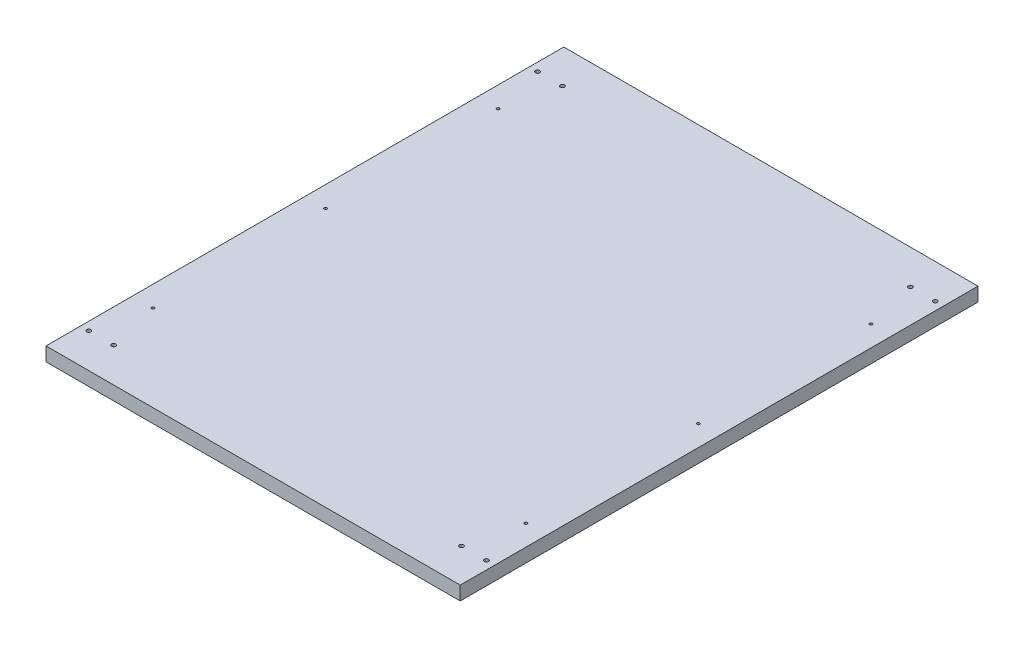
ISO-10303-21;
HEADER;
FILE_DESCRIPTION(('STEP AP214'),'2;1');
FILE_NAME('part.step','',(''),(''),'','','');
FILE_SCHEMA(('AUTOMOTIVE_DESIGN { 1 0 10303 214 1 1 1 1 }'));
ENDSEC;
DATA;
#1=APPLICATION_CONTEXT('core data for automotive mechanical design processes');
#2=APPLICATION_PROTOCOL_DEFINITION('international standard','automotive_design',2000,#1);
#3=PRODUCT_CONTEXT('',#1,'mechanical');
#4=PRODUCT('Part','Part','',(#3));
#5=PRODUCT_RELATED_PRODUCT_CATEGORY('part','',(#4));
#6=PRODUCT_DEFINITION_FORMATION('','',#4);
#7=PRODUCT_DEFINITION_CONTEXT('part definition',#1,'design');
#8=PRODUCT_DEFINITION('design','',#6,#7);
#9=PRODUCT_DEFINITION_SHAPE('','',#8);
#10=(LENGTH_UNIT() NAMED_UNIT(*) SI_UNIT(.MILLI.,.METRE.));
#11=(NAMED_UNIT(*) PLANE_ANGLE_UNIT() SI_UNIT($,.RADIAN.));
#12=(NAMED_UNIT(*) SI_UNIT($,.STERADIAN.) SOLID_ANGLE_UNIT());
#13=UNCERTAINTY_MEASURE_WITH_UNIT(LENGTH_MEASURE(1.E-05),#10,'distance_accuracy_value','');
#14=(GEOMETRIC_REPRESENTATION_CONTEXT(3) GLOBAL_UNCERTAINTY_ASSIGNED_CONTEXT((#13)) GLOBAL_UNIT_ASSIGNED_CONTEXT((#10,
#11,#12)) REPRESENTATION_CONTEXT('',''));
#15=CARTESIAN_POINT('',(0.,0.,0.));
#16=DIRECTION('',(0.,0.,1.));
#17=DIRECTION('',(1.,0.,0.));
#18=AXIS2_PLACEMENT_3D('',#15,#16,#17);
#19=CARTESIAN_POINT('',(0.,20.,-750.));
#20=DIRECTION('',(1.,0.,0.));
#21=DIRECTION('',(0.,0.,-1.));
#22=AXIS2_PLACEMENT_3D('',#19,#20,#21);
#23=PLANE('',#22);
#24=DIRECTION('',(0.,0.,1.));
#25=VECTOR('',#24,1.);
#26=CARTESIAN_POINT('',(0.,0.,-750.));
#27=LINE('',#26,#25);
#28=CARTESIAN_POINT('',(0.,0.,-750.));
#29=VERTEX_POINT('',#28);
#30=CARTESIAN_POINT('',(0.,0.,0.));
#31=VERTEX_POINT('',#30);
#32=EDGE_CURVE('E106',#29,#31,#27,.T.);
#33=ORIENTED_EDGE('',*,*,#32,.T.);
#34=DIRECTION('',(0.,-1.,0.));
#35=VECTOR('',#34,1.);
#36=CARTESIAN_POINT('',(0.,20.,0.));
#37=LINE('',#36,#35);
#38=CARTESIAN_POINT('',(0.,20.,0.));
#39=VERTEX_POINT('',#38);
#40=EDGE_CURVE('E11',#39,#31,#37,.T.);
#41=ORIENTED_EDGE('',*,*,#40,.F.);
#42=DIRECTION('',(0.,0.,1.));
#43=VECTOR('',#42,1.);
#44=CARTESIAN_POINT('',(0.,20.,-750.));
#45=LINE('',#44,#43);
#46=CARTESIAN_POINT('',(0.,20.,-750.));
#47=VERTEX_POINT('',#46);
#48=EDGE_CURVE('E90',#47,#39,#45,.T.);
#49=ORIENTED_EDGE('',*,*,#48,.F.);
#50=DIRECTION('',(0.,-1.,0.));
#51=VECTOR('',#50,1.);
#52=CARTESIAN_POINT('',(0.,20.,-750.));
#53=LINE('',#52,#51);
#54=EDGE_CURVE('E102',#47,#29,#53,.T.);
#55=ORIENTED_EDGE('',*,*,#54,.T.);
#56=EDGE_LOOP('',(#33,#41,#49,#55));
#57=FACE_BOUND('',#56,.T.);
#58=ADVANCED_FACE('F38',(#57),#23,.F.);
#59=CARTESIAN_POINT('',(0.,20.,0.));
#60=DIRECTION('',(0.,0.,-1.));
#61=DIRECTION('',(-1.,0.,0.));
#62=AXIS2_PLACEMENT_3D('',#59,#60,#61);
#63=PLANE('',#62);
#64=DIRECTION('',(1.,0.,0.));
#65=VECTOR('',#64,1.);
#66=CARTESIAN_POINT('',(0.,0.,0.));
#67=LINE('',#66,#65);
#68=CARTESIAN_POINT('',(600.,0.,0.));
#69=VERTEX_POINT('',#68);
#70=EDGE_CURVE('E95',#31,#69,#67,.T.);
#71=ORIENTED_EDGE('',*,*,#70,.T.);
#72=DIRECTION('',(0.,-1.,0.));
#73=VECTOR('',#72,1.);
#74=CARTESIAN_POINT('',(600.,20.,0.));
#75=LINE('',#74,#73);
#76=CARTESIAN_POINT('',(600.,20.,0.));
#77=VERTEX_POINT('',#76);
#78=EDGE_CURVE('E47',#77,#69,#75,.T.);
#79=ORIENTED_EDGE('',*,*,#78,.F.);
#80=DIRECTION('',(1.,0.,0.));
#81=VECTOR('',#80,1.);
#82=CARTESIAN_POINT('',(0.,20.,0.));
#83=LINE('',#82,#81);
#84=EDGE_CURVE('E85',#39,#77,#83,.T.);
#85=ORIENTED_EDGE('',*,*,#84,.F.);
#86=ORIENTED_EDGE('',*,*,#40,.T.);
#87=EDGE_LOOP('',(#71,#79,#85,#86));
#88=FACE_BOUND('',#87,.T.);
#89=ADVANCED_FACE('F94',(#88),#63,.F.);
#90=CARTESIAN_POINT('',(600.,20.,0.));
#91=DIRECTION('',(-1.,0.,0.));
#92=DIRECTION('',(0.,0.,1.));
#93=AXIS2_PLACEMENT_3D('',#90,#91,#92);
#94=PLANE('',#93);
#95=DIRECTION('',(0.,0.,-1.));
#96=VECTOR('',#95,1.);
#97=CARTESIAN_POINT('',(600.,0.,0.));
#98=LINE('',#97,#96);
#99=CARTESIAN_POINT('',(600.,0.,-750.));
#100=VERTEX_POINT('',#99);
#101=EDGE_CURVE('E72',#69,#100,#98,.T.);
#102=ORIENTED_EDGE('',*,*,#101,.T.);
#103=DIRECTION('',(0.,-1.,0.));
#104=VECTOR('',#103,1.);
#105=CARTESIAN_POINT('',(600.,20.,-750.));
#106=LINE('',#105,#104);
#107=CARTESIAN_POINT('',(600.,20.,-750.));
#108=VERTEX_POINT('',#107);
#109=EDGE_CURVE('E97',#108,#100,#106,.T.);
#110=ORIENTED_EDGE('',*,*,#109,.F.);
#111=DIRECTION('',(0.,0.,-1.));
#112=VECTOR('',#111,1.);
#113=CARTESIAN_POINT('',(600.,20.,0.));
#114=LINE('',#113,#112);
#115=EDGE_CURVE('E88',#77,#108,#114,.T.);
#116=ORIENTED_EDGE('',*,*,#115,.F.);
#117=ORIENTED_EDGE('',*,*,#78,.T.);
#118=EDGE_LOOP('',(#102,#110,#116,#117));
#119=FACE_BOUND('',#118,.T.);
#120=ADVANCED_FACE('F98',(#119),#94,.F.);
#121=CARTESIAN_POINT('',(600.,20.,-750.));
#122=DIRECTION('',(0.,0.,1.));
#123=DIRECTION('',(1.,0.,0.));
#124=AXIS2_PLACEMENT_3D('',#121,#122,#123);
#125=PLANE('',#124);
#126=DIRECTION('',(-1.,0.,0.));
#127=VECTOR('',#126,1.);
#128=CARTESIAN_POINT('',(600.,0.,-750.));
#129=LINE('',#128,#127);
#130=EDGE_CURVE('E78',#100,#29,#129,.T.);
#131=ORIENTED_EDGE('',*,*,#130,.T.);
#132=ORIENTED_EDGE('',*,*,#54,.F.);
#133=DIRECTION('',(-1.,0.,0.));
#134=VECTOR('',#133,1.);
#135=CARTESIAN_POINT('',(600.,20.,-750.));
#136=LINE('',#135,#134);
#137=EDGE_CURVE('E55',#108,#47,#136,.T.);
#138=ORIENTED_EDGE('',*,*,#137,.F.);
#139=ORIENTED_EDGE('',*,*,#109,.T.);
#140=EDGE_LOOP('',(#131,#132,#138,#139));
#141=FACE_BOUND('',#140,.T.);
#142=ADVANCED_FACE('F120',(#141),#125,.F.);
#143=CARTESIAN_POINT('',(0.,20.,0.));
#144=DIRECTION('',(0.,1.,0.));
#145=DIRECTION('',(0.,0.,1.));
#146=AXIS2_PLACEMENT_3D('',#143,#144,#145);
#147=PLANE('',#146);
#148=CARTESIAN_POINT('',(570.,20.,-625.));
#149=DIRECTION('',(0.,1.,0.));
#150=DIRECTION('',(0.,0.,1.));
#151=AXIS2_PLACEMENT_3D('',#148,#149,#150);
#152=CIRCLE('',#151,2.);
#153=CARTESIAN_POINT('',(570.,20.,-623.));
#154=VERTEX_POINT('',#153);
#155=EDGE_CURVE('E224',#154,#154,#152,.T.);
#156=ORIENTED_EDGE('',*,*,#155,.F.);
#157=EDGE_LOOP('',(#156));
#158=FACE_BOUND('',#157,.T.);
#159=CARTESIAN_POINT('',(570.,20.,-375.));
#160=DIRECTION('',(0.,1.,0.));
#161=DIRECTION('',(0.,0.,1.));
#162=AXIS2_PLACEMENT_3D('',#159,#160,#161);
#163=CIRCLE('',#162,2.);
#164=CARTESIAN_POINT('',(570.,20.,-373.));
#165=VERTEX_POINT('',#164);
#166=EDGE_CURVE('E216',#165,#165,#163,.T.);
#167=ORIENTED_EDGE('',*,*,#166,.F.);
#168=EDGE_LOOP('',(#167));
#169=FACE_BOUND('',#168,.T.);
#170=CARTESIAN_POINT('',(30.,20.,-375.));
#171=DIRECTION('',(0.,1.,0.));
#172=DIRECTION('',(0.,0.,1.));
#173=AXIS2_PLACEMENT_3D('',#170,#171,#172);
#174=CIRCLE('',#173,2.);
#175=CARTESIAN_POINT('',(30.,20.,-373.));
#176=VERTEX_POINT('',#175);
#177=EDGE_CURVE('E208',#176,#176,#174,.T.);
#178=ORIENTED_EDGE('',*,*,#177,.F.);
#179=EDGE_LOOP('',(#178));
#180=FACE_BOUND('',#179,.T.);
#181=CARTESIAN_POINT('',(30.,20.,-125.));
#182=DIRECTION('',(0.,1.,0.));
#183=DIRECTION('',(0.,0.,1.));
#184=AXIS2_PLACEMENT_3D('',#181,#182,#183);
#185=CIRCLE('',#184,2.);
#186=CARTESIAN_POINT('',(30.,20.,-123.));
#187=VERTEX_POINT('',#186);
#188=EDGE_CURVE('E199',#187,#187,#185,.T.);
#189=ORIENTED_EDGE('',*,*,#188,.F.);
#190=EDGE_LOOP('',(#189));
#191=FACE_BOUND('',#190,.T.);
#192=CARTESIAN_POINT('',(570.,20.,-125.));
#193=DIRECTION('',(0.,1.,0.));
#194=DIRECTION('',(0.,0.,1.));
#195=AXIS2_PLACEMENT_3D('',#192,#193,#194);
#196=CIRCLE('',#195,2.);
#197=CARTESIAN_POINT('',(570.,20.,-123.));
#198=VERTEX_POINT('',#197);
#199=EDGE_CURVE('E231',#198,#198,#196,.T.);
#200=ORIENTED_EDGE('',*,*,#199,.F.);
#201=EDGE_LOOP('',(#200));
#202=FACE_BOUND('',#201,.T.);
#203=CARTESIAN_POINT('',(30.,20.,-625.));
#204=DIRECTION('',(0.,1.,0.));
#205=DIRECTION('',(0.,0.,1.));
#206=AXIS2_PLACEMENT_3D('',#203,#204,#205);
#207=CIRCLE('',#206,2.);
#208=CARTESIAN_POINT('',(30.,20.,-623.));
#209=VERTEX_POINT('',#208);
#210=EDGE_CURVE('E191',#209,#209,#207,.T.);
#211=ORIENTED_EDGE('',*,*,#210,.F.);
#212=EDGE_LOOP('',(#211));
#213=FACE_BOUND('',#212,.T.);
#214=CARTESIAN_POINT('',(552.,20.,-700.));
#215=DIRECTION('',(0.,1.,0.));
#216=DIRECTION('',(0.,0.,1.));
#217=AXIS2_PLACEMENT_3D('',#214,#215,#216);
#218=CIRCLE('',#217,3.00000000000005);
#219=CARTESIAN_POINT('',(552.,20.,-697.));
#220=VERTEX_POINT('',#219);
#221=EDGE_CURVE('E151',#220,#220,#218,.T.);
#222=ORIENTED_EDGE('',*,*,#221,.F.);
#223=EDGE_LOOP('',(#222));
#224=FACE_BOUND('',#223,.T.);
#225=CARTESIAN_POINT('',(12.,20.,-50.));
#226=DIRECTION('',(0.,1.,0.));
#227=DIRECTION('',(0.,0.,1.));
#228=AXIS2_PLACEMENT_3D('',#225,#226,#227);
#229=CIRCLE('',#228,3.);
#230=CARTESIAN_POINT('',(12.,20.,-47.));
#231=VERTEX_POINT('',#230);
#232=EDGE_CURVE('E160',#231,#231,#229,.T.);
#233=ORIENTED_EDGE('',*,*,#232,.F.);
#234=EDGE_LOOP('',(#233));
#235=FACE_BOUND('',#234,.T.);
#236=CARTESIAN_POINT('',(588.,20.,-50.));
#237=DIRECTION('',(0.,1.,0.));
#238=DIRECTION('',(0.,0.,1.));
#239=AXIS2_PLACEMENT_3D('',#236,#237,#238);
#240=CIRCLE('',#239,3.00000000000005);
#241=CARTESIAN_POINT('',(588.,20.,-47.));
#242=VERTEX_POINT('',#241);
#243=EDGE_CURVE('E135',#242,#242,#240,.T.);
#244=ORIENTED_EDGE('',*,*,#243,.F.);
#245=EDGE_LOOP('',(#244));
#246=FACE_BOUND('',#245,.T.);
#247=CARTESIAN_POINT('',(48.,20.,-50.));
#248=DIRECTION('',(0.,1.,0.));
#249=DIRECTION('',(0.,0.,1.));
#250=AXIS2_PLACEMENT_3D('',#247,#248,#249);
#251=CIRCLE('',#250,3.);
#252=CARTESIAN_POINT('',(48.,20.,-47.));
#253=VERTEX_POINT('',#252);
#254=EDGE_CURVE('E144',#253,#253,#251,.T.);
#255=ORIENTED_EDGE('',*,*,#254,.F.);
#256=EDGE_LOOP('',(#255));
#257=FACE_BOUND('',#256,.T.);
#258=CARTESIAN_POINT('',(588.,20.,-700.));
#259=DIRECTION('',(0.,1.,0.));
#260=DIRECTION('',(0.,0.,1.));
#261=AXIS2_PLACEMENT_3D('',#258,#259,#260);
#262=CIRCLE('',#261,3.00000000000005);
#263=CARTESIAN_POINT('',(588.,20.,-697.));
#264=VERTEX_POINT('',#263);
#265=EDGE_CURVE('E184',#264,#264,#262,.T.);
#266=ORIENTED_EDGE('',*,*,#265,.F.);
#267=EDGE_LOOP('',(#266));
#268=FACE_BOUND('',#267,.T.);
#269=CARTESIAN_POINT('',(47.9999999999999,20.,-700.));
#270=DIRECTION('',(0.,1.,0.));
#271=DIRECTION('',(0.,0.,1.));
#272=AXIS2_PLACEMENT_3D('',#269,#270,#271);
#273=CIRCLE('',#272,3.);
#274=CARTESIAN_POINT('',(47.9999999999999,20.,-697.));
#275=VERTEX_POINT('',#274);
#276=EDGE_CURVE('E176',#275,#275,#273,.T.);
#277=ORIENTED_EDGE('',*,*,#276,.F.);
#278=EDGE_LOOP('',(#277));
#279=FACE_BOUND('',#278,.T.);
#280=CARTESIAN_POINT('',(12.,20.,-700.));
#281=DIRECTION('',(0.,1.,0.));
#282=DIRECTION('',(0.,0.,1.));
#283=AXIS2_PLACEMENT_3D('',#280,#281,#282);
#284=CIRCLE('',#283,3.);
#285=CARTESIAN_POINT('',(12.,20.,-697.));
#286=VERTEX_POINT('',#285);
#287=EDGE_CURVE('E167',#286,#286,#284,.T.);
#288=ORIENTED_EDGE('',*,*,#287,.F.);
#289=EDGE_LOOP('',(#288));
#290=FACE_BOUND('',#289,.T.);
#291=CARTESIAN_POINT('',(552.,20.,-50.));
#292=DIRECTION('',(0.,1.,0.));
#293=DIRECTION('',(0.,0.,1.));
#294=AXIS2_PLACEMENT_3D('',#291,#292,#293);
#295=CIRCLE('',#294,3.00000000000005);
#296=CARTESIAN_POINT('',(552.,20.,-47.));
#297=VERTEX_POINT('',#296);
#298=EDGE_CURVE('E127',#297,#297,#295,.T.);
#299=ORIENTED_EDGE('',*,*,#298,.F.);
#300=EDGE_LOOP('',(#299));
#301=FACE_BOUND('',#300,.T.);
#302=ORIENTED_EDGE('',*,*,#48,.T.);
#303=ORIENTED_EDGE('',*,*,#84,.T.);
#304=ORIENTED_EDGE('',*,*,#115,.T.);
#305=ORIENTED_EDGE('',*,*,#137,.T.);
#306=EDGE_LOOP('',(#302,#303,#304,#305));
#307=FACE_BOUND('',#306,.T.);
#308=ADVANCED_FACE('F86',(#158,#169,#180,#191,#202,#213,#224,#235,#246,#257,#268,#279,#290,#301,
#307),#147,.T.);
#309=CARTESIAN_POINT('',(0.,0.,0.));
#310=DIRECTION('',(0.,1.,0.));
#311=DIRECTION('',(0.,0.,1.));
#312=AXIS2_PLACEMENT_3D('',#309,#310,#311);
#313=PLANE('',#312);
#314=CARTESIAN_POINT('',(570.,0.,-625.));
#315=DIRECTION('',(0.,1.,0.));
#316=DIRECTION('',(0.,0.,1.));
#317=AXIS2_PLACEMENT_3D('',#314,#315,#316);
#318=CIRCLE('',#317,2.);
#319=CARTESIAN_POINT('',(570.,0.,-623.));
#320=VERTEX_POINT('',#319);
#321=EDGE_CURVE('E195',#320,#320,#318,.T.);
#322=ORIENTED_EDGE('',*,*,#321,.T.);
#323=EDGE_LOOP('',(#322));
#324=FACE_BOUND('',#323,.T.);
#325=CARTESIAN_POINT('',(570.,0.,-375.));
#326=DIRECTION('',(0.,1.,0.));
#327=DIRECTION('',(0.,0.,1.));
#328=AXIS2_PLACEMENT_3D('',#325,#326,#327);
#329=CIRCLE('',#328,2.);
#330=CARTESIAN_POINT('',(570.,0.,-373.));
#331=VERTEX_POINT('',#330);
#332=EDGE_CURVE('E220',#331,#331,#329,.T.);
#333=ORIENTED_EDGE('',*,*,#332,.T.);
#334=EDGE_LOOP('',(#333));
#335=FACE_BOUND('',#334,.T.);
#336=CARTESIAN_POINT('',(30.,0.,-375.));
#337=DIRECTION('',(0.,1.,0.));
#338=DIRECTION('',(0.,0.,1.));
#339=AXIS2_PLACEMENT_3D('',#336,#337,#338);
#340=CIRCLE('',#339,2.);
#341=CARTESIAN_POINT('',(30.,0.,-373.));
#342=VERTEX_POINT('',#341);
#343=EDGE_CURVE('E212',#342,#342,#340,.T.);
#344=ORIENTED_EDGE('',*,*,#343,.T.);
#345=EDGE_LOOP('',(#344));
#346=FACE_BOUND('',#345,.T.);
#347=CARTESIAN_POINT('',(30.,0.,-125.));
#348=DIRECTION('',(0.,1.,0.));
#349=DIRECTION('',(0.,0.,1.));
#350=AXIS2_PLACEMENT_3D('',#347,#348,#349);
#351=CIRCLE('',#350,2.);
#352=CARTESIAN_POINT('',(30.,0.,-123.));
#353=VERTEX_POINT('',#352);
#354=EDGE_CURVE('E203',#353,#353,#351,.T.);
#355=ORIENTED_EDGE('',*,*,#354,.T.);
#356=EDGE_LOOP('',(#355));
#357=FACE_BOUND('',#356,.T.);
#358=CARTESIAN_POINT('',(570.,0.,-125.));
#359=DIRECTION('',(0.,1.,0.));
#360=DIRECTION('',(0.,0.,1.));
#361=AXIS2_PLACEMENT_3D('',#358,#359,#360);
#362=CIRCLE('',#361,2.);
#363=CARTESIAN_POINT('',(570.,0.,-123.));
#364=VERTEX_POINT('',#363);
#365=EDGE_CURVE('E204',#364,#364,#362,.T.);
#366=ORIENTED_EDGE('',*,*,#365,.T.);
#367=EDGE_LOOP('',(#366));
#368=FACE_BOUND('',#367,.T.);
#369=CARTESIAN_POINT('',(30.,0.,-625.));
#370=DIRECTION('',(0.,1.,0.));
#371=DIRECTION('',(0.,0.,1.));
#372=AXIS2_PLACEMENT_3D('',#369,#370,#371);
#373=CIRCLE('',#372,2.);
#374=CARTESIAN_POINT('',(30.,0.,-623.));
#375=VERTEX_POINT('',#374);
#376=EDGE_CURVE('E172',#375,#375,#373,.T.);
#377=ORIENTED_EDGE('',*,*,#376,.T.);
#378=EDGE_LOOP('',(#377));
#379=FACE_BOUND('',#378,.T.);
#380=CARTESIAN_POINT('',(552.,0.,-700.));
#381=DIRECTION('',(0.,1.,0.));
#382=DIRECTION('',(0.,0.,1.));
#383=AXIS2_PLACEMENT_3D('',#380,#381,#382);
#384=CIRCLE('',#383,3.00000000000005);
#385=CARTESIAN_POINT('',(552.,0.,-697.));
#386=VERTEX_POINT('',#385);
#387=EDGE_CURVE('E155',#386,#386,#384,.T.);
#388=ORIENTED_EDGE('',*,*,#387,.T.);
#389=EDGE_LOOP('',(#388));
#390=FACE_BOUND('',#389,.T.);
#391=CARTESIAN_POINT('',(12.,0.,-50.));
#392=DIRECTION('',(0.,1.,0.));
#393=DIRECTION('',(0.,0.,1.));
#394=AXIS2_PLACEMENT_3D('',#391,#392,#393);
#395=CIRCLE('',#394,3.);
#396=CARTESIAN_POINT('',(12.,0.,-47.));
#397=VERTEX_POINT('',#396);
#398=EDGE_CURVE('E140',#397,#397,#395,.T.);
#399=ORIENTED_EDGE('',*,*,#398,.T.);
#400=EDGE_LOOP('',(#399));
#401=FACE_BOUND('',#400,.T.);
#402=CARTESIAN_POINT('',(588.,0.,-50.));
#403=DIRECTION('',(0.,1.,0.));
#404=DIRECTION('',(0.,0.,1.));
#405=AXIS2_PLACEMENT_3D('',#402,#403,#404);
#406=CIRCLE('',#405,3.00000000000005);
#407=CARTESIAN_POINT('',(588.,0.,-47.));
#408=VERTEX_POINT('',#407);
#409=EDGE_CURVE('E139',#408,#408,#406,.T.);
#410=ORIENTED_EDGE('',*,*,#409,.T.);
#411=EDGE_LOOP('',(#410));
#412=FACE_BOUND('',#411,.T.);
#413=CARTESIAN_POINT('',(48.,0.,-50.));
#414=DIRECTION('',(0.,1.,0.));
#415=DIRECTION('',(0.,0.,1.));
#416=AXIS2_PLACEMENT_3D('',#413,#414,#415);
#417=CIRCLE('',#416,3.);
#418=CARTESIAN_POINT('',(48.,0.,-47.));
#419=VERTEX_POINT('',#418);
#420=EDGE_CURVE('E131',#419,#419,#417,.T.);
#421=ORIENTED_EDGE('',*,*,#420,.T.);
#422=EDGE_LOOP('',(#421));
#423=FACE_BOUND('',#422,.T.);
#424=CARTESIAN_POINT('',(588.,0.,-700.));
#425=DIRECTION('',(0.,1.,0.));
#426=DIRECTION('',(0.,0.,1.));
#427=AXIS2_PLACEMENT_3D('',#424,#425,#426);
#428=CIRCLE('',#427,3.00000000000005);
#429=CARTESIAN_POINT('',(588.,0.,-697.));
#430=VERTEX_POINT('',#429);
#431=EDGE_CURVE('E156',#430,#430,#428,.T.);
#432=ORIENTED_EDGE('',*,*,#431,.T.);
#433=EDGE_LOOP('',(#432));
#434=FACE_BOUND('',#433,.T.);
#435=CARTESIAN_POINT('',(47.9999999999999,0.,-700.));
#436=DIRECTION('',(0.,1.,0.));
#437=DIRECTION('',(0.,0.,1.));
#438=AXIS2_PLACEMENT_3D('',#435,#436,#437);
#439=CIRCLE('',#438,3.);
#440=CARTESIAN_POINT('',(47.9999999999999,0.,-697.));
#441=VERTEX_POINT('',#440);
#442=EDGE_CURVE('E180',#441,#441,#439,.T.);
#443=ORIENTED_EDGE('',*,*,#442,.T.);
#444=EDGE_LOOP('',(#443));
#445=FACE_BOUND('',#444,.T.);
#446=CARTESIAN_POINT('',(12.,0.,-700.));
#447=DIRECTION('',(0.,1.,0.));
#448=DIRECTION('',(0.,0.,1.));
#449=AXIS2_PLACEMENT_3D('',#446,#447,#448);
#450=CIRCLE('',#449,3.);
#451=CARTESIAN_POINT('',(12.,0.,-697.));
#452=VERTEX_POINT('',#451);
#453=EDGE_CURVE('E171',#452,#452,#450,.T.);
#454=ORIENTED_EDGE('',*,*,#453,.T.);
#455=EDGE_LOOP('',(#454));
#456=FACE_BOUND('',#455,.T.);
#457=CARTESIAN_POINT('',(552.,0.,-50.));
#458=DIRECTION('',(0.,1.,0.));
#459=DIRECTION('',(0.,0.,1.));
#460=AXIS2_PLACEMENT_3D('',#457,#458,#459);
#461=CIRCLE('',#460,3.00000000000005);
#462=CARTESIAN_POINT('',(552.,0.,-47.));
#463=VERTEX_POINT('',#462);
#464=EDGE_CURVE('E110',#463,#463,#461,.T.);
#465=ORIENTED_EDGE('',*,*,#464,.T.);
#466=EDGE_LOOP('',(#465));
#467=FACE_BOUND('',#466,.T.);
#468=ORIENTED_EDGE('',*,*,#32,.F.);
#469=ORIENTED_EDGE('',*,*,#130,.F.);
#470=ORIENTED_EDGE('',*,*,#101,.F.);
#471=ORIENTED_EDGE('',*,*,#70,.F.);
#472=EDGE_LOOP('',(#468,#469,#470,#471));
#473=FACE_BOUND('',#472,.T.);
#474=ADVANCED_FACE('F123',(#324,#335,#346,#357,#368,#379,#390,#401,#412,#423,#434,#445,#456,
#467,#473),#313,.F.);
#475=CARTESIAN_POINT('',(552.,0.,-50.));
#476=DIRECTION('',(0.,1.,0.));
#477=DIRECTION('',(0.,0.,1.));
#478=AXIS2_PLACEMENT_3D('',#475,#476,#477);
#479=CYLINDRICAL_SURFACE('',#478,3.00000000000005);
#480=ORIENTED_EDGE('',*,*,#464,.F.);
#481=EDGE_LOOP('',(#480));
#482=FACE_BOUND('',#481,.T.);
#483=ORIENTED_EDGE('',*,*,#298,.T.);
#484=EDGE_LOOP('',(#483));
#485=FACE_BOUND('',#484,.T.);
#486=ADVANCED_FACE('F271',(#482,#485),#479,.F.);
#487=CARTESIAN_POINT('',(12.,0.,-700.));
#488=DIRECTION('',(0.,1.,0.));
#489=DIRECTION('',(0.,0.,1.));
#490=AXIS2_PLACEMENT_3D('',#487,#488,#489);
#491=CYLINDRICAL_SURFACE('',#490,3.);
#492=ORIENTED_EDGE('',*,*,#453,.F.);
#493=EDGE_LOOP('',(#492));
#494=FACE_BOUND('',#493,.T.);
#495=ORIENTED_EDGE('',*,*,#287,.T.);
#496=EDGE_LOOP('',(#495));
#497=FACE_BOUND('',#496,.T.);
#498=ADVANCED_FACE('F273',(#494,#497),#491,.F.);
#499=CARTESIAN_POINT('',(47.9999999999999,0.,-700.));
#500=DIRECTION('',(0.,1.,0.));
#501=DIRECTION('',(0.,0.,1.));
#502=AXIS2_PLACEMENT_3D('',#499,#500,#501);
#503=CYLINDRICAL_SURFACE('',#502,3.);
#504=ORIENTED_EDGE('',*,*,#442,.F.);
#505=EDGE_LOOP('',(#504));
#506=FACE_BOUND('',#505,.T.);
#507=ORIENTED_EDGE('',*,*,#276,.T.);
#508=EDGE_LOOP('',(#507));
#509=FACE_BOUND('',#508,.T.);
#510=ADVANCED_FACE('F280',(#506,#509),#503,.F.);
#511=CARTESIAN_POINT('',(588.,0.,-700.));
#512=DIRECTION('',(0.,1.,0.));
#513=DIRECTION('',(0.,0.,1.));
#514=AXIS2_PLACEMENT_3D('',#511,#512,#513);
#515=CYLINDRICAL_SURFACE('',#514,3.00000000000005);
#516=ORIENTED_EDGE('',*,*,#431,.F.);
#517=EDGE_LOOP('',(#516));
#518=FACE_BOUND('',#517,.T.);
#519=ORIENTED_EDGE('',*,*,#265,.T.);
#520=EDGE_LOOP('',(#519));
#521=FACE_BOUND('',#520,.T.);
#522=ADVANCED_FACE('F377',(#518,#521),#515,.F.);
#523=CARTESIAN_POINT('',(48.,0.,-50.));
#524=DIRECTION('',(0.,1.,0.));
#525=DIRECTION('',(0.,0.,1.));
#526=AXIS2_PLACEMENT_3D('',#523,#524,#525);
#527=CYLINDRICAL_SURFACE('',#526,3.);
#528=ORIENTED_EDGE('',*,*,#420,.F.);
#529=EDGE_LOOP('',(#528));
#530=FACE_BOUND('',#529,.T.);
#531=ORIENTED_EDGE('',*,*,#254,.T.);
#532=EDGE_LOOP('',(#531));
#533=FACE_BOUND('',#532,.T.);
#534=ADVANCED_FACE('F380',(#530,#533),#527,.F.);
#535=CARTESIAN_POINT('',(588.,0.,-50.));
#536=DIRECTION('',(0.,1.,0.));
#537=DIRECTION('',(0.,0.,1.));
#538=AXIS2_PLACEMENT_3D('',#535,#536,#537);
#539=CYLINDRICAL_SURFACE('',#538,3.00000000000005);
#540=ORIENTED_EDGE('',*,*,#409,.F.);
#541=EDGE_LOOP('',(#540));
#542=FACE_BOUND('',#541,.T.);
#543=ORIENTED_EDGE('',*,*,#243,.T.);
#544=EDGE_LOOP('',(#543));
#545=FACE_BOUND('',#544,.T.);
#546=ADVANCED_FACE('F388',(#542,#545),#539,.F.);
#547=CARTESIAN_POINT('',(12.,0.,-50.));
#548=DIRECTION('',(0.,1.,0.));
#549=DIRECTION('',(0.,0.,1.));
#550=AXIS2_PLACEMENT_3D('',#547,#548,#549);
#551=CYLINDRICAL_SURFACE('',#550,3.);
#552=ORIENTED_EDGE('',*,*,#398,.F.);
#553=EDGE_LOOP('',(#552));
#554=FACE_BOUND('',#553,.T.);
#555=ORIENTED_EDGE('',*,*,#232,.T.);
#556=EDGE_LOOP('',(#555));
#557=FACE_BOUND('',#556,.T.);
#558=ADVANCED_FACE('F385',(#554,#557),#551,.F.);
#559=CARTESIAN_POINT('',(552.,0.,-700.));
#560=DIRECTION('',(0.,1.,0.));
#561=DIRECTION('',(0.,0.,1.));
#562=AXIS2_PLACEMENT_3D('',#559,#560,#561);
#563=CYLINDRICAL_SURFACE('',#562,3.00000000000005);
#564=ORIENTED_EDGE('',*,*,#387,.F.);
#565=EDGE_LOOP('',(#564));
#566=FACE_BOUND('',#565,.T.);
#567=ORIENTED_EDGE('',*,*,#221,.T.);
#568=EDGE_LOOP('',(#567));
#569=FACE_BOUND('',#568,.T.);
#570=ADVANCED_FACE('F322',(#566,#569),#563,.F.);
#571=CARTESIAN_POINT('',(30.,0.,-625.));
#572=DIRECTION('',(0.,1.,0.));
#573=DIRECTION('',(0.,0.,1.));
#574=AXIS2_PLACEMENT_3D('',#571,#572,#573);
#575=CYLINDRICAL_SURFACE('',#574,2.);
#576=ORIENTED_EDGE('',*,*,#376,.F.);
#577=EDGE_LOOP('',(#576));
#578=FACE_BOUND('',#577,.T.);
#579=ORIENTED_EDGE('',*,*,#210,.T.);
#580=EDGE_LOOP('',(#579));
#581=FACE_BOUND('',#580,.T.);
#582=ADVANCED_FACE('F245',(#578,#581),#575,.F.);
#583=CARTESIAN_POINT('',(570.,0.,-125.));
#584=DIRECTION('',(0.,1.,0.));
#585=DIRECTION('',(0.,0.,1.));
#586=AXIS2_PLACEMENT_3D('',#583,#584,#585);
#587=CYLINDRICAL_SURFACE('',#586,2.);
#588=ORIENTED_EDGE('',*,*,#365,.F.);
#589=EDGE_LOOP('',(#588));
#590=FACE_BOUND('',#589,.T.);
#591=ORIENTED_EDGE('',*,*,#199,.T.);
#592=EDGE_LOOP('',(#591));
#593=FACE_BOUND('',#592,.T.);
#594=ADVANCED_FACE('F241',(#590,#593),#587,.F.);
#595=CARTESIAN_POINT('',(30.,0.,-125.));
#596=DIRECTION('',(0.,1.,0.));
#597=DIRECTION('',(0.,0.,1.));
#598=AXIS2_PLACEMENT_3D('',#595,#596,#597);
#599=CYLINDRICAL_SURFACE('',#598,2.);
#600=ORIENTED_EDGE('',*,*,#354,.F.);
#601=EDGE_LOOP('',(#600));
#602=FACE_BOUND('',#601,.T.);
#603=ORIENTED_EDGE('',*,*,#188,.T.);
#604=EDGE_LOOP('',(#603));
#605=FACE_BOUND('',#604,.T.);
#606=ADVANCED_FACE('F244',(#602,#605),#599,.F.);
#607=CARTESIAN_POINT('',(30.,0.,-375.));
#608=DIRECTION('',(0.,1.,0.));
#609=DIRECTION('',(0.,0.,1.));
#610=AXIS2_PLACEMENT_3D('',#607,#608,#609);
#611=CYLINDRICAL_SURFACE('',#610,2.);
#612=ORIENTED_EDGE('',*,*,#343,.F.);
#613=EDGE_LOOP('',(#612));
#614=FACE_BOUND('',#613,.T.);
#615=ORIENTED_EDGE('',*,*,#177,.T.);
#616=EDGE_LOOP('',(#615));
#617=FACE_BOUND('',#616,.T.);
#618=ADVANCED_FACE('F340',(#614,#617),#611,.F.);
#619=CARTESIAN_POINT('',(570.,0.,-375.));
#620=DIRECTION('',(0.,1.,0.));
#621=DIRECTION('',(0.,0.,1.));
#622=AXIS2_PLACEMENT_3D('',#619,#620,#621);
#623=CYLINDRICAL_SURFACE('',#622,2.);
#624=ORIENTED_EDGE('',*,*,#332,.F.);
#625=EDGE_LOOP('',(#624));
#626=FACE_BOUND('',#625,.T.);
#627=ORIENTED_EDGE('',*,*,#166,.T.);
#628=EDGE_LOOP('',(#627));
#629=FACE_BOUND('',#628,.T.);
#630=ADVANCED_FACE('F350',(#626,#629),#623,.F.);
#631=CARTESIAN_POINT('',(570.,0.,-625.));
#632=DIRECTION('',(0.,1.,0.));
#633=DIRECTION('',(0.,0.,1.));
#634=AXIS2_PLACEMENT_3D('',#631,#632,#633);
#635=CYLINDRICAL_SURFACE('',#634,2.);
#636=ORIENTED_EDGE('',*,*,#321,.F.);
#637=EDGE_LOOP('',(#636));
#638=FACE_BOUND('',#637,.T.);
#639=ORIENTED_EDGE('',*,*,#155,.T.);
#640=EDGE_LOOP('',(#639));
#641=FACE_BOUND('',#640,.T.);
#642=ADVANCED_FACE('F360',(#638,#641),#635,.F.);
#643=CLOSED_SHELL('',(#58,#89,#120,#142,#308,#474,#486,#498,#510,#522,#534,#546,#558,#570,#582,
#594,#606,#618,#630,#642));
#644=MANIFOLD_SOLID_BREP('B2',#643);
#645=ADVANCED_BREP_SHAPE_REPRESENTATION('',(#18,#644),#14);
#646=SHAPE_DEFINITION_REPRESENTATION(#9,#645);
ENDSEC;
END-ISO-10303-21;
